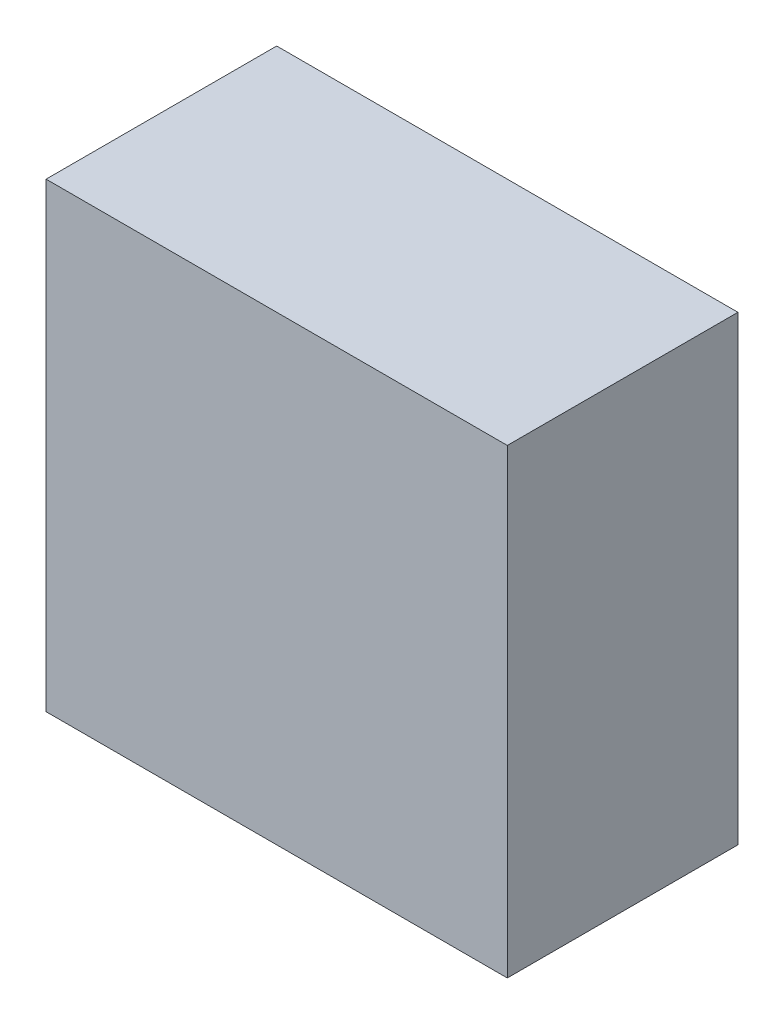
ISO-10303-21;
HEADER;
FILE_DESCRIPTION(('STEP AP214'),'2;1');
FILE_NAME('part.step','',(''),(''),'','','');
FILE_SCHEMA(('AUTOMOTIVE_DESIGN { 1 0 10303 214 1 1 1 1 }'));
ENDSEC;
DATA;
#1=APPLICATION_CONTEXT('core data for automotive mechanical design processes');
#2=APPLICATION_PROTOCOL_DEFINITION('international standard','automotive_design',2000,#1);
#3=PRODUCT_CONTEXT('',#1,'mechanical');
#4=PRODUCT('Part','Part','',(#3));
#5=PRODUCT_RELATED_PRODUCT_CATEGORY('part','',(#4));
#6=PRODUCT_DEFINITION_FORMATION('','',#4);
#7=PRODUCT_DEFINITION_CONTEXT('part definition',#1,'design');
#8=PRODUCT_DEFINITION('design','',#6,#7);
#9=PRODUCT_DEFINITION_SHAPE('','',#8);
#10=(LENGTH_UNIT() NAMED_UNIT(*) SI_UNIT(.MILLI.,.METRE.));
#11=(NAMED_UNIT(*) PLANE_ANGLE_UNIT() SI_UNIT($,.RADIAN.));
#12=(NAMED_UNIT(*) SI_UNIT($,.STERADIAN.) SOLID_ANGLE_UNIT());
#13=UNCERTAINTY_MEASURE_WITH_UNIT(LENGTH_MEASURE(1.E-05),#10,'distance_accuracy_value','');
#14=(GEOMETRIC_REPRESENTATION_CONTEXT(3) GLOBAL_UNCERTAINTY_ASSIGNED_CONTEXT((#13)) GLOBAL_UNIT_ASSIGNED_CONTEXT((#10,
#11,#12)) REPRESENTATION_CONTEXT('',''));
#15=CARTESIAN_POINT('',(0.,0.,0.));
#16=DIRECTION('',(0.,0.,1.));
#17=DIRECTION('',(1.,0.,0.));
#18=AXIS2_PLACEMENT_3D('',#15,#16,#17);
#19=CARTESIAN_POINT('',(-30.,60.,-15.));
#20=DIRECTION('',(1.,0.,0.));
#21=DIRECTION('',(0.,0.,-1.));
#22=AXIS2_PLACEMENT_3D('',#19,#20,#21);
#23=PLANE('',#22);
#24=DIRECTION('',(0.,0.,1.));
#25=VECTOR('',#24,1.);
#26=CARTESIAN_POINT('',(-30.,0.,-15.));
#27=LINE('',#26,#25);
#28=CARTESIAN_POINT('',(-30.,0.,-15.));
#29=VERTEX_POINT('',#28);
#30=CARTESIAN_POINT('',(-30.,0.,15.));
#31=VERTEX_POINT('',#30);
#32=EDGE_CURVE('E95',#29,#31,#27,.T.);
#33=ORIENTED_EDGE('',*,*,#32,.T.);
#34=DIRECTION('',(0.,-1.,0.));
#35=VECTOR('',#34,1.);
#36=CARTESIAN_POINT('',(-30.,60.,15.));
#37=LINE('',#36,#35);
#38=CARTESIAN_POINT('',(-30.,60.,15.));
#39=VERTEX_POINT('',#38);
#40=EDGE_CURVE('E11',#39,#31,#37,.T.);
#41=ORIENTED_EDGE('',*,*,#40,.F.);
#42=DIRECTION('',(0.,0.,1.));
#43=VECTOR('',#42,1.);
#44=CARTESIAN_POINT('',(-30.,60.,-15.));
#45=LINE('',#44,#43);
#46=CARTESIAN_POINT('',(-30.,60.,-15.));
#47=VERTEX_POINT('',#46);
#48=EDGE_CURVE('E81',#47,#39,#45,.T.);
#49=ORIENTED_EDGE('',*,*,#48,.F.);
#50=DIRECTION('',(0.,-1.,0.));
#51=VECTOR('',#50,1.);
#52=CARTESIAN_POINT('',(-30.,60.,-15.));
#53=LINE('',#52,#51);
#54=EDGE_CURVE('E48',#47,#29,#53,.T.);
#55=ORIENTED_EDGE('',*,*,#54,.T.);
#56=EDGE_LOOP('',(#33,#41,#49,#55));
#57=FACE_BOUND('',#56,.T.);
#58=ADVANCED_FACE('F32',(#57),#23,.F.);
#59=CARTESIAN_POINT('',(-30.,60.,15.));
#60=DIRECTION('',(0.,0.,-1.));
#61=DIRECTION('',(-1.,0.,0.));
#62=AXIS2_PLACEMENT_3D('',#59,#60,#61);
#63=PLANE('',#62);
#64=DIRECTION('',(1.,0.,0.));
#65=VECTOR('',#64,1.);
#66=CARTESIAN_POINT('',(-30.,0.,15.));
#67=LINE('',#66,#65);
#68=CARTESIAN_POINT('',(30.,0.,15.));
#69=VERTEX_POINT('',#68);
#70=EDGE_CURVE('E86',#31,#69,#67,.T.);
#71=ORIENTED_EDGE('',*,*,#70,.T.);
#72=DIRECTION('',(0.,-1.,0.));
#73=VECTOR('',#72,1.);
#74=CARTESIAN_POINT('',(30.,60.,15.));
#75=LINE('',#74,#73);
#76=CARTESIAN_POINT('',(30.,60.,15.));
#77=VERTEX_POINT('',#76);
#78=EDGE_CURVE('E40',#77,#69,#75,.T.);
#79=ORIENTED_EDGE('',*,*,#78,.F.);
#80=DIRECTION('',(1.,0.,0.));
#81=VECTOR('',#80,1.);
#82=CARTESIAN_POINT('',(-30.,60.,15.));
#83=LINE('',#82,#81);
#84=EDGE_CURVE('E73',#39,#77,#83,.T.);
#85=ORIENTED_EDGE('',*,*,#84,.F.);
#86=ORIENTED_EDGE('',*,*,#40,.T.);
#87=EDGE_LOOP('',(#71,#79,#85,#86));
#88=FACE_BOUND('',#87,.T.);
#89=ADVANCED_FACE('F85',(#88),#63,.F.);
#90=CARTESIAN_POINT('',(30.,60.,-15.));
#91=DIRECTION('',(1.,0.,0.));
#92=DIRECTION('',(0.,0.,-1.));
#93=AXIS2_PLACEMENT_3D('',#90,#91,#92);
#94=PLANE('',#93);
#95=DIRECTION('',(0.,0.,1.));
#96=VECTOR('',#95,1.);
#97=CARTESIAN_POINT('',(30.,0.,-15.));
#98=LINE('',#97,#96);
#99=CARTESIAN_POINT('',(30.,0.,-15.));
#100=VERTEX_POINT('',#99);
#101=EDGE_CURVE('E98',#100,#69,#98,.T.);
#102=ORIENTED_EDGE('',*,*,#101,.F.);
#103=DIRECTION('',(0.,-1.,0.));
#104=VECTOR('',#103,1.);
#105=CARTESIAN_POINT('',(30.,60.,-15.));
#106=LINE('',#105,#104);
#107=CARTESIAN_POINT('',(30.,60.,-15.));
#108=VERTEX_POINT('',#107);
#109=EDGE_CURVE('E62',#108,#100,#106,.T.);
#110=ORIENTED_EDGE('',*,*,#109,.F.);
#111=DIRECTION('',(0.,0.,1.));
#112=VECTOR('',#111,1.);
#113=CARTESIAN_POINT('',(30.,60.,-15.));
#114=LINE('',#113,#112);
#115=EDGE_CURVE('E80',#108,#77,#114,.T.);
#116=ORIENTED_EDGE('',*,*,#115,.T.);
#117=ORIENTED_EDGE('',*,*,#78,.T.);
#118=EDGE_LOOP('',(#102,#110,#116,#117));
#119=FACE_BOUND('',#118,.T.);
#120=ADVANCED_FACE('F89',(#119),#94,.T.);
#121=CARTESIAN_POINT('',(-30.,60.,-15.));
#122=DIRECTION('',(0.,0.,-1.));
#123=DIRECTION('',(-1.,0.,0.));
#124=AXIS2_PLACEMENT_3D('',#121,#122,#123);
#125=PLANE('',#124);
#126=DIRECTION('',(1.,0.,0.));
#127=VECTOR('',#126,1.);
#128=CARTESIAN_POINT('',(-30.,0.,-15.));
#129=LINE('',#128,#127);
#130=EDGE_CURVE('E100',#29,#100,#129,.T.);
#131=ORIENTED_EDGE('',*,*,#130,.F.);
#132=ORIENTED_EDGE('',*,*,#54,.F.);
#133=DIRECTION('',(1.,0.,0.));
#134=VECTOR('',#133,1.);
#135=CARTESIAN_POINT('',(-30.,60.,-15.));
#136=LINE('',#135,#134);
#137=EDGE_CURVE('E90',#47,#108,#136,.T.);
#138=ORIENTED_EDGE('',*,*,#137,.T.);
#139=ORIENTED_EDGE('',*,*,#109,.T.);
#140=EDGE_LOOP('',(#131,#132,#138,#139));
#141=FACE_BOUND('',#140,.T.);
#142=ADVANCED_FACE('F106',(#141),#125,.T.);
#143=CARTESIAN_POINT('',(0.,60.,0.));
#144=DIRECTION('',(0.,1.,0.));
#145=DIRECTION('',(0.,0.,1.));
#146=AXIS2_PLACEMENT_3D('',#143,#144,#145);
#147=PLANE('',#146);
#148=ORIENTED_EDGE('',*,*,#48,.T.);
#149=ORIENTED_EDGE('',*,*,#84,.T.);
#150=ORIENTED_EDGE('',*,*,#115,.F.);
#151=ORIENTED_EDGE('',*,*,#137,.F.);
#152=EDGE_LOOP('',(#148,#149,#150,#151));
#153=FACE_BOUND('',#152,.T.);
#154=ADVANCED_FACE('F77',(#153),#147,.T.);
#155=CARTESIAN_POINT('',(0.,0.,0.));
#156=DIRECTION('',(0.,1.,0.));
#157=DIRECTION('',(0.,0.,1.));
#158=AXIS2_PLACEMENT_3D('',#155,#156,#157);
#159=PLANE('',#158);
#160=ORIENTED_EDGE('',*,*,#32,.F.);
#161=ORIENTED_EDGE('',*,*,#130,.T.);
#162=ORIENTED_EDGE('',*,*,#101,.T.);
#163=ORIENTED_EDGE('',*,*,#70,.F.);
#164=EDGE_LOOP('',(#160,#161,#162,#163));
#165=FACE_BOUND('',#164,.T.);
#166=ADVANCED_FACE('F105',(#165),#159,.F.);
#167=CLOSED_SHELL('',(#58,#89,#120,#142,#154,#166));
#168=MANIFOLD_SOLID_BREP('B2',#167);
#169=ADVANCED_BREP_SHAPE_REPRESENTATION('',(#18,#168),#14);
#170=SHAPE_DEFINITION_REPRESENTATION(#9,#169);
ENDSEC;
END-ISO-10303-21;
